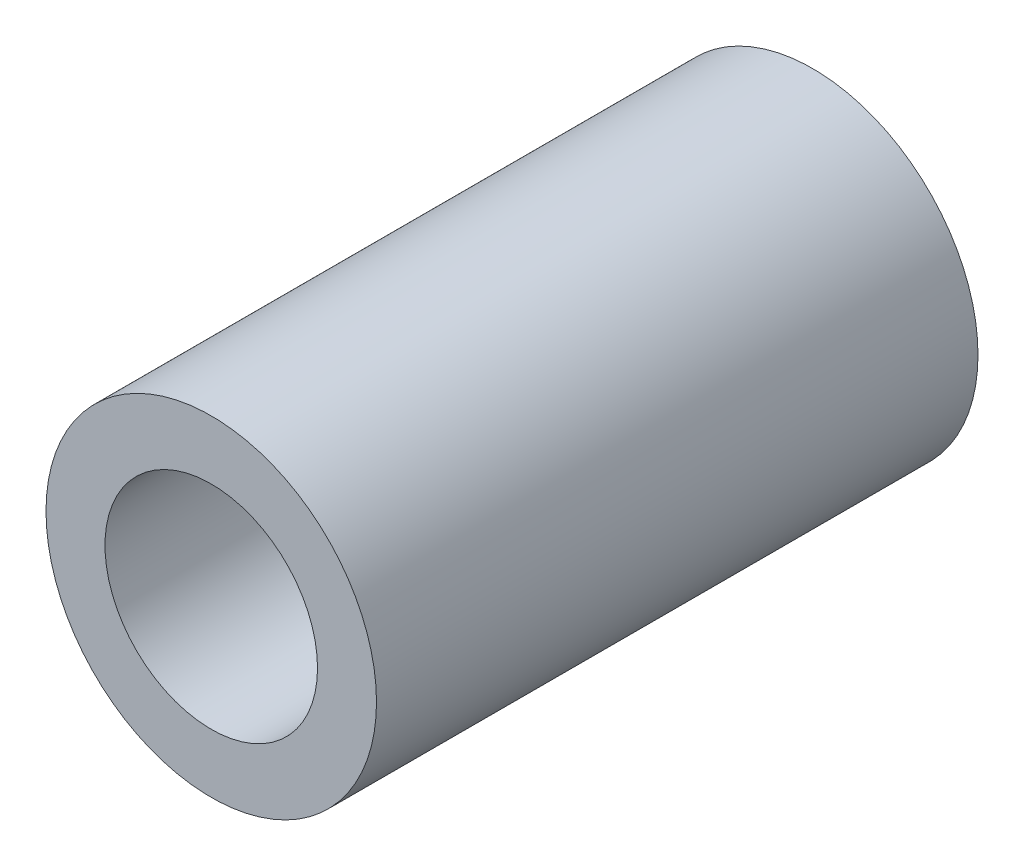
ISO-10303-21;
HEADER;
FILE_DESCRIPTION(('STEP AP214'),'2;1');
FILE_NAME('part.step','',(''),(''),'','','');
FILE_SCHEMA(('AUTOMOTIVE_DESIGN { 1 0 10303 214 1 1 1 1 }'));
ENDSEC;
DATA;
#1=APPLICATION_CONTEXT('core data for automotive mechanical design processes');
#2=APPLICATION_PROTOCOL_DEFINITION('international standard','automotive_design',2000,#1);
#3=PRODUCT_CONTEXT('',#1,'mechanical');
#4=PRODUCT('Part','Part','',(#3));
#5=PRODUCT_RELATED_PRODUCT_CATEGORY('part','',(#4));
#6=PRODUCT_DEFINITION_FORMATION('','',#4);
#7=PRODUCT_DEFINITION_CONTEXT('part definition',#1,'design');
#8=PRODUCT_DEFINITION('design','',#6,#7);
#9=PRODUCT_DEFINITION_SHAPE('','',#8);
#10=(LENGTH_UNIT() NAMED_UNIT(*) SI_UNIT(.MILLI.,.METRE.));
#11=(NAMED_UNIT(*) PLANE_ANGLE_UNIT() SI_UNIT($,.RADIAN.));
#12=(NAMED_UNIT(*) SI_UNIT($,.STERADIAN.) SOLID_ANGLE_UNIT());
#13=UNCERTAINTY_MEASURE_WITH_UNIT(LENGTH_MEASURE(1.E-05),#10,'distance_accuracy_value','');
#14=(GEOMETRIC_REPRESENTATION_CONTEXT(3) GLOBAL_UNCERTAINTY_ASSIGNED_CONTEXT((#13)) GLOBAL_UNIT_ASSIGNED_CONTEXT((#10,
#11,#12)) REPRESENTATION_CONTEXT('',''));
#15=CARTESIAN_POINT('',(0.,0.,0.));
#16=DIRECTION('',(0.,0.,1.));
#17=DIRECTION('',(1.,0.,0.));
#18=AXIS2_PLACEMENT_3D('',#15,#16,#17);
#19=CARTESIAN_POINT('',(0.,0.,56.6));
#20=DIRECTION('',(0.,0.,1.));
#21=DIRECTION('',(1.,0.,0.));
#22=AXIS2_PLACEMENT_3D('',#19,#20,#21);
#23=PLANE('',#22);
#24=CARTESIAN_POINT('',(0.,0.,56.6));
#25=DIRECTION('',(0.,0.,1.));
#26=DIRECTION('',(1.,0.,0.));
#27=AXIS2_PLACEMENT_3D('',#24,#25,#26);
#28=CIRCLE('',#27,15.55);
#29=CARTESIAN_POINT('',(15.55,0.,56.6));
#30=VERTEX_POINT('',#29);
#31=EDGE_CURVE('E10',#30,#30,#28,.T.);
#32=ORIENTED_EDGE('',*,*,#31,.T.);
#33=EDGE_LOOP('',(#32));
#34=FACE_BOUND('',#33,.T.);
#35=CARTESIAN_POINT('',(0.,0.,56.6));
#36=DIRECTION('',(0.,0.,1.));
#37=DIRECTION('',(1.,0.,0.));
#38=AXIS2_PLACEMENT_3D('',#35,#36,#37);
#39=CIRCLE('',#38,10.);
#40=CARTESIAN_POINT('',(10.,0.,56.6));
#41=VERTEX_POINT('',#40);
#42=EDGE_CURVE('E62',#41,#41,#39,.T.);
#43=ORIENTED_EDGE('',*,*,#42,.F.);
#44=EDGE_LOOP('',(#43));
#45=FACE_BOUND('',#44,.T.);
#46=ADVANCED_FACE('F47',(#34,#45),#23,.T.);
#47=CARTESIAN_POINT('',(0.,0.,0.));
#48=DIRECTION('',(0.,0.,1.));
#49=DIRECTION('',(1.,0.,0.));
#50=AXIS2_PLACEMENT_3D('',#47,#48,#49);
#51=PLANE('',#50);
#52=CARTESIAN_POINT('',(0.,0.,0.));
#53=DIRECTION('',(0.,0.,1.));
#54=DIRECTION('',(1.,0.,0.));
#55=AXIS2_PLACEMENT_3D('',#52,#53,#54);
#56=CIRCLE('',#55,15.55);
#57=CARTESIAN_POINT('',(15.55,0.,0.));
#58=VERTEX_POINT('',#57);
#59=EDGE_CURVE('E51',#58,#58,#56,.T.);
#60=ORIENTED_EDGE('',*,*,#59,.F.);
#61=EDGE_LOOP('',(#60));
#62=FACE_BOUND('',#61,.T.);
#63=CARTESIAN_POINT('',(0.,0.,0.));
#64=DIRECTION('',(0.,0.,1.));
#65=DIRECTION('',(1.,0.,0.));
#66=AXIS2_PLACEMENT_3D('',#63,#64,#65);
#67=CIRCLE('',#66,10.);
#68=CARTESIAN_POINT('',(10.,0.,0.));
#69=VERTEX_POINT('',#68);
#70=EDGE_CURVE('E64',#69,#69,#67,.T.);
#71=ORIENTED_EDGE('',*,*,#70,.T.);
#72=EDGE_LOOP('',(#71));
#73=FACE_BOUND('',#72,.T.);
#74=ADVANCED_FACE('F76',(#62,#73),#51,.F.);
#75=CARTESIAN_POINT('',(0.,0.,56.6));
#76=DIRECTION('',(0.,0.,-1.));
#77=DIRECTION('',(-1.,0.,0.));
#78=AXIS2_PLACEMENT_3D('',#75,#76,#77);
#79=CYLINDRICAL_SURFACE('',#78,15.55);
#80=ORIENTED_EDGE('',*,*,#31,.F.);
#81=EDGE_LOOP('',(#80));
#82=FACE_BOUND('',#81,.T.);
#83=ORIENTED_EDGE('',*,*,#59,.T.);
#84=EDGE_LOOP('',(#83));
#85=FACE_BOUND('',#84,.T.);
#86=ADVANCED_FACE('F49',(#82,#85),#79,.T.);
#87=CARTESIAN_POINT('',(0.,0.,56.6));
#88=DIRECTION('',(0.,0.,-1.));
#89=DIRECTION('',(-1.,0.,0.));
#90=AXIS2_PLACEMENT_3D('',#87,#88,#89);
#91=CYLINDRICAL_SURFACE('',#90,10.);
#92=ORIENTED_EDGE('',*,*,#42,.T.);
#93=EDGE_LOOP('',(#92));
#94=FACE_BOUND('',#93,.T.);
#95=ORIENTED_EDGE('',*,*,#70,.F.);
#96=EDGE_LOOP('',(#95));
#97=FACE_BOUND('',#96,.T.);
#98=ADVANCED_FACE('F72',(#94,#97),#91,.F.);
#99=CLOSED_SHELL('',(#46,#74,#86,#98));
#100=MANIFOLD_SOLID_BREP('B2',#99);
#101=ADVANCED_BREP_SHAPE_REPRESENTATION('',(#18,#100),#14);
#102=SHAPE_DEFINITION_REPRESENTATION(#9,#101);
ENDSEC;
END-ISO-10303-21;
